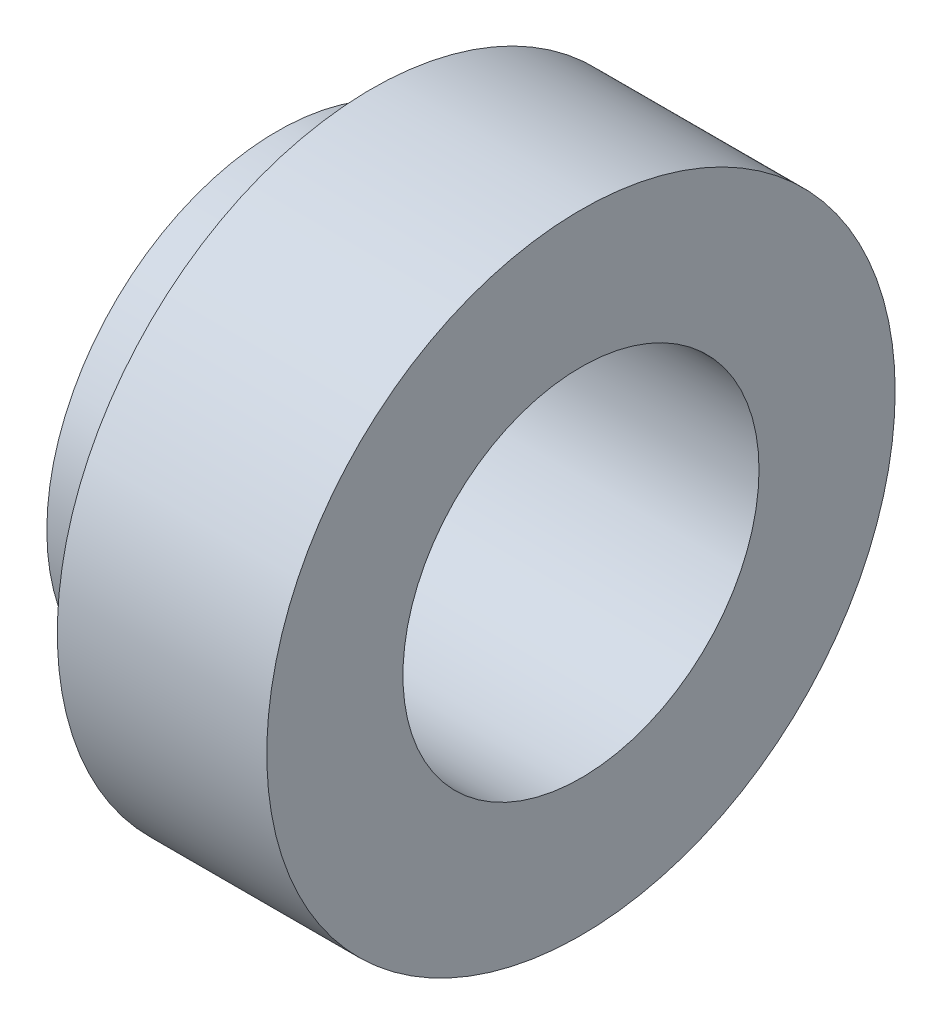
ISO-10303-21;
HEADER;
FILE_DESCRIPTION(('STEP AP214'),'2;1');
FILE_NAME('part.step','',(''),(''),'','','');
FILE_SCHEMA(('AUTOMOTIVE_DESIGN { 1 0 10303 214 1 1 1 1 }'));
ENDSEC;
DATA;
#1=APPLICATION_CONTEXT('core data for automotive mechanical design processes');
#2=APPLICATION_PROTOCOL_DEFINITION('international standard','automotive_design',2000,#1);
#3=PRODUCT_CONTEXT('',#1,'mechanical');
#4=PRODUCT('Part','Part','',(#3));
#5=PRODUCT_RELATED_PRODUCT_CATEGORY('part','',(#4));
#6=PRODUCT_DEFINITION_FORMATION('','',#4);
#7=PRODUCT_DEFINITION_CONTEXT('part definition',#1,'design');
#8=PRODUCT_DEFINITION('design','',#6,#7);
#9=PRODUCT_DEFINITION_SHAPE('','',#8);
#10=(LENGTH_UNIT() NAMED_UNIT(*) SI_UNIT(.MILLI.,.METRE.));
#11=(NAMED_UNIT(*) PLANE_ANGLE_UNIT() SI_UNIT($,.RADIAN.));
#12=(NAMED_UNIT(*) SI_UNIT($,.STERADIAN.) SOLID_ANGLE_UNIT());
#13=UNCERTAINTY_MEASURE_WITH_UNIT(LENGTH_MEASURE(1.E-05),#10,'distance_accuracy_value','');
#14=(GEOMETRIC_REPRESENTATION_CONTEXT(3) GLOBAL_UNCERTAINTY_ASSIGNED_CONTEXT((#13)) GLOBAL_UNIT_ASSIGNED_CONTEXT((#10,
#11,#12)) REPRESENTATION_CONTEXT('',''));
#15=CARTESIAN_POINT('',(0.,0.,0.));
#16=DIRECTION('',(0.,0.,1.));
#17=DIRECTION('',(1.,0.,0.));
#18=AXIS2_PLACEMENT_3D('',#15,#16,#17);
#19=CARTESIAN_POINT('',(0.,0.,0.));
#20=DIRECTION('',(1.,0.,0.));
#21=DIRECTION('',(0.,0.,-1.));
#22=AXIS2_PLACEMENT_3D('',#19,#20,#21);
#23=PLANE('',#22);
#24=CARTESIAN_POINT('',(0.,0.,0.));
#25=DIRECTION('',(1.,0.,0.));
#26=DIRECTION('',(0.,0.,-1.));
#27=AXIS2_PLACEMENT_3D('',#24,#25,#26);
#28=CIRCLE('',#27,11.);
#29=CARTESIAN_POINT('',(0.,0.,-11.));
#30=VERTEX_POINT('',#29);
#31=EDGE_CURVE('E66',#30,#30,#28,.T.);
#32=ORIENTED_EDGE('',*,*,#31,.F.);
#33=EDGE_LOOP('',(#32));
#34=FACE_BOUND('',#33,.T.);
#35=CARTESIAN_POINT('',(0.,0.,0.));
#36=DIRECTION('',(1.,0.,0.));
#37=DIRECTION('',(0.,0.,-1.));
#38=AXIS2_PLACEMENT_3D('',#35,#36,#37);
#39=CIRCLE('',#38,8.5);
#40=CARTESIAN_POINT('',(0.,0.,-8.5));
#41=VERTEX_POINT('',#40);
#42=EDGE_CURVE('E10',#41,#41,#39,.T.);
#43=ORIENTED_EDGE('',*,*,#42,.T.);
#44=EDGE_LOOP('',(#43));
#45=FACE_BOUND('',#44,.T.);
#46=ADVANCED_FACE('F39',(#34,#45),#23,.F.);
#47=CARTESIAN_POINT('',(14.5,0.,0.));
#48=DIRECTION('',(1.,0.,0.));
#49=DIRECTION('',(0.,0.,-1.));
#50=AXIS2_PLACEMENT_3D('',#47,#48,#49);
#51=CYLINDRICAL_SURFACE('',#50,8.5);
#52=CARTESIAN_POINT('',(14.5,0.,0.));
#53=DIRECTION('',(1.,0.,0.));
#54=DIRECTION('',(0.,0.,-1.));
#55=AXIS2_PLACEMENT_3D('',#52,#53,#54);
#56=CIRCLE('',#55,8.5);
#57=CARTESIAN_POINT('',(14.5,0.,-8.5));
#58=VERTEX_POINT('',#57);
#59=EDGE_CURVE('E46',#58,#58,#56,.T.);
#60=ORIENTED_EDGE('',*,*,#59,.T.);
#61=EDGE_LOOP('',(#60));
#62=FACE_BOUND('',#61,.T.);
#63=ORIENTED_EDGE('',*,*,#42,.F.);
#64=EDGE_LOOP('',(#63));
#65=FACE_BOUND('',#64,.T.);
#66=ADVANCED_FACE('F74',(#62,#65),#51,.F.);
#67=CARTESIAN_POINT('',(14.5,0.,0.));
#68=DIRECTION('',(-1.,0.,0.));
#69=DIRECTION('',(0.,0.,1.));
#70=AXIS2_PLACEMENT_3D('',#67,#68,#69);
#71=PLANE('',#70);
#72=ORIENTED_EDGE('',*,*,#59,.F.);
#73=EDGE_LOOP('',(#72));
#74=FACE_BOUND('',#73,.T.);
#75=CARTESIAN_POINT('',(14.5,0.,0.));
#76=DIRECTION('',(1.,0.,0.));
#77=DIRECTION('',(0.,0.,-1.));
#78=AXIS2_PLACEMENT_3D('',#75,#76,#77);
#79=CIRCLE('',#78,15.);
#80=CARTESIAN_POINT('',(14.5,0.,-15.));
#81=VERTEX_POINT('',#80);
#82=EDGE_CURVE('E51',#81,#81,#79,.T.);
#83=ORIENTED_EDGE('',*,*,#82,.T.);
#84=EDGE_LOOP('',(#83));
#85=FACE_BOUND('',#84,.T.);
#86=ADVANCED_FACE('F78',(#74,#85),#71,.F.);
#87=CARTESIAN_POINT('',(14.5,0.,0.));
#88=DIRECTION('',(1.,0.,0.));
#89=DIRECTION('',(0.,0.,-1.));
#90=AXIS2_PLACEMENT_3D('',#87,#88,#89);
#91=CYLINDRICAL_SURFACE('',#90,15.);
#92=ORIENTED_EDGE('',*,*,#82,.F.);
#93=EDGE_LOOP('',(#92));
#94=FACE_BOUND('',#93,.T.);
#95=CARTESIAN_POINT('',(4.5,0.,0.));
#96=DIRECTION('',(1.,0.,0.));
#97=DIRECTION('',(0.,0.,-1.));
#98=AXIS2_PLACEMENT_3D('',#95,#96,#97);
#99=CIRCLE('',#98,15.);
#100=CARTESIAN_POINT('',(4.5,0.,-15.));
#101=VERTEX_POINT('',#100);
#102=EDGE_CURVE('E56',#101,#101,#99,.T.);
#103=ORIENTED_EDGE('',*,*,#102,.T.);
#104=EDGE_LOOP('',(#103));
#105=FACE_BOUND('',#104,.T.);
#106=ADVANCED_FACE('F82',(#94,#105),#91,.T.);
#107=CARTESIAN_POINT('',(4.5,0.,0.));
#108=DIRECTION('',(1.,0.,0.));
#109=DIRECTION('',(0.,0.,-1.));
#110=AXIS2_PLACEMENT_3D('',#107,#108,#109);
#111=PLANE('',#110);
#112=ORIENTED_EDGE('',*,*,#102,.F.);
#113=EDGE_LOOP('',(#112));
#114=FACE_BOUND('',#113,.T.);
#115=CARTESIAN_POINT('',(4.5,0.,0.));
#116=DIRECTION('',(1.,0.,0.));
#117=DIRECTION('',(0.,0.,-1.));
#118=AXIS2_PLACEMENT_3D('',#115,#116,#117);
#119=CIRCLE('',#118,11.);
#120=CARTESIAN_POINT('',(4.5,0.,-11.));
#121=VERTEX_POINT('',#120);
#122=EDGE_CURVE('E62',#121,#121,#119,.T.);
#123=ORIENTED_EDGE('',*,*,#122,.T.);
#124=EDGE_LOOP('',(#123));
#125=FACE_BOUND('',#124,.T.);
#126=ADVANCED_FACE('F89',(#114,#125),#111,.F.);
#127=CARTESIAN_POINT('',(14.5,0.,0.));
#128=DIRECTION('',(1.,0.,0.));
#129=DIRECTION('',(0.,0.,-1.));
#130=AXIS2_PLACEMENT_3D('',#127,#128,#129);
#131=CYLINDRICAL_SURFACE('',#130,11.);
#132=ORIENTED_EDGE('',*,*,#122,.F.);
#133=EDGE_LOOP('',(#132));
#134=FACE_BOUND('',#133,.T.);
#135=ORIENTED_EDGE('',*,*,#31,.T.);
#136=EDGE_LOOP('',(#135));
#137=FACE_BOUND('',#136,.T.);
#138=ADVANCED_FACE('F71',(#134,#137),#131,.T.);
#139=CLOSED_SHELL('',(#46,#66,#86,#106,#126,#138));
#140=MANIFOLD_SOLID_BREP('B2',#139);
#141=ADVANCED_BREP_SHAPE_REPRESENTATION('',(#18,#140),#14);
#142=SHAPE_DEFINITION_REPRESENTATION(#9,#141);
ENDSEC;
END-ISO-10303-21;
